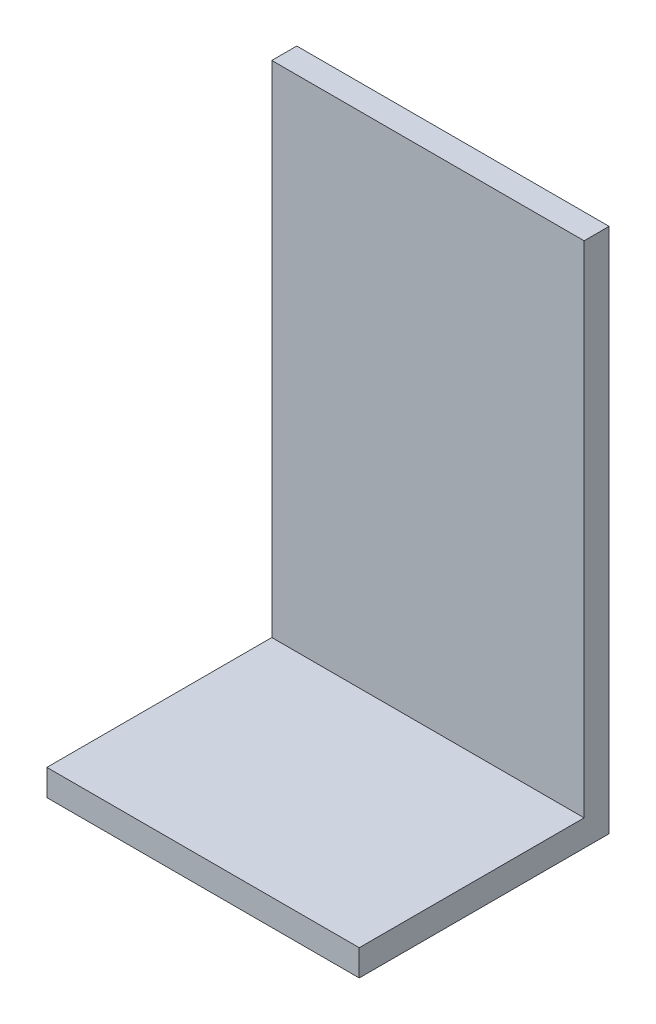
ISO-10303-21;
HEADER;
FILE_DESCRIPTION(('STEP AP214'),'2;1');
FILE_NAME('part.step','',(''),(''),'','','');
FILE_SCHEMA(('AUTOMOTIVE_DESIGN { 1 0 10303 214 1 1 1 1 }'));
ENDSEC;
DATA;
#1=APPLICATION_CONTEXT('core data for automotive mechanical design processes');
#2=APPLICATION_PROTOCOL_DEFINITION('international standard','automotive_design',2000,#1);
#3=PRODUCT_CONTEXT('',#1,'mechanical');
#4=PRODUCT('Part','Part','',(#3));
#5=PRODUCT_RELATED_PRODUCT_CATEGORY('part','',(#4));
#6=PRODUCT_DEFINITION_FORMATION('','',#4);
#7=PRODUCT_DEFINITION_CONTEXT('part definition',#1,'design');
#8=PRODUCT_DEFINITION('design','',#6,#7);
#9=PRODUCT_DEFINITION_SHAPE('','',#8);
#10=(LENGTH_UNIT() NAMED_UNIT(*) SI_UNIT(.MILLI.,.METRE.));
#11=(NAMED_UNIT(*) PLANE_ANGLE_UNIT() SI_UNIT($,.RADIAN.));
#12=(NAMED_UNIT(*) SI_UNIT($,.STERADIAN.) SOLID_ANGLE_UNIT());
#13=UNCERTAINTY_MEASURE_WITH_UNIT(LENGTH_MEASURE(1.E-05),#10,'distance_accuracy_value','');
#14=(GEOMETRIC_REPRESENTATION_CONTEXT(3) GLOBAL_UNCERTAINTY_ASSIGNED_CONTEXT((#13)) GLOBAL_UNIT_ASSIGNED_CONTEXT((#10,
#11,#12)) REPRESENTATION_CONTEXT('',''));
#15=CARTESIAN_POINT('',(0.,0.,0.));
#16=DIRECTION('',(0.,0.,1.));
#17=DIRECTION('',(1.,0.,0.));
#18=AXIS2_PLACEMENT_3D('',#15,#16,#17);
#19=CARTESIAN_POINT('',(0.22167930040457,-1.5105,0.2));
#20=DIRECTION('',(0.,0.,1.));
#21=DIRECTION('',(0.,-1.,0.));
#22=AXIS2_PLACEMENT_3D('',#19,#20,#21);
#23=PLANE('',#22);
#24=DIRECTION('',(0.,-1.,0.));
#25=VECTOR('',#24,1.);
#26=CARTESIAN_POINT('',(0.0966793004045692,-1.36847101449275,0.2));
#27=LINE('',#26,#25);
#28=CARTESIAN_POINT('',(0.0966793004045694,-1.5,0.2));
#29=VERTEX_POINT('',#28);
#30=CARTESIAN_POINT('',(0.0966793004045697,-1.521,0.2));
#31=VERTEX_POINT('',#30);
#32=EDGE_CURVE('E110',#29,#31,#27,.T.);
#33=ORIENTED_EDGE('',*,*,#32,.T.);
#34=DIRECTION('',(1.,0.,0.));
#35=VECTOR('',#34,1.);
#36=CARTESIAN_POINT('',(0.22167930040457,-1.521,0.2));
#37=LINE('',#36,#35);
#38=CARTESIAN_POINT('',(0.34667930040457,-1.521,0.2));
#39=VERTEX_POINT('',#38);
#40=EDGE_CURVE('E106',#31,#39,#37,.T.);
#41=ORIENTED_EDGE('',*,*,#40,.T.);
#42=DIRECTION('',(0.,-1.,0.));
#43=VECTOR('',#42,1.);
#44=CARTESIAN_POINT('',(0.346679300404569,-1.36847101449275,0.2));
#45=LINE('',#44,#43);
#46=CARTESIAN_POINT('',(0.34667930040457,-1.5,0.2));
#47=VERTEX_POINT('',#46);
#48=EDGE_CURVE('E147',#47,#39,#45,.T.);
#49=ORIENTED_EDGE('',*,*,#48,.F.);
#50=DIRECTION('',(1.,0.,0.));
#51=VECTOR('',#50,1.);
#52=CARTESIAN_POINT('',(0.22167930040457,-1.5,0.2));
#53=LINE('',#52,#51);
#54=EDGE_CURVE('E25',#29,#47,#53,.T.);
#55=ORIENTED_EDGE('',*,*,#54,.F.);
#56=EDGE_LOOP('',(#33,#41,#49,#55));
#57=FACE_BOUND('',#56,.T.);
#58=ADVANCED_FACE('F17',(#57),#23,.T.);
#59=CARTESIAN_POINT('',(0.221679300404569,-1.3,0.02));
#60=DIRECTION('',(0.,0.,1.));
#61=DIRECTION('',(0.,-1.,0.));
#62=AXIS2_PLACEMENT_3D('',#59,#60,#61);
#63=PLANE('',#62);
#64=DIRECTION('',(0.,-1.,0.));
#65=VECTOR('',#64,1.);
#66=CARTESIAN_POINT('',(0.346679300404569,-1.36847101449275,0.02));
#67=LINE('',#66,#65);
#68=CARTESIAN_POINT('',(0.346679300404568,-1.1,0.02));
#69=VERTEX_POINT('',#68);
#70=CARTESIAN_POINT('',(0.34667930040457,-1.5,0.02));
#71=VERTEX_POINT('',#70);
#72=EDGE_CURVE('E139',#69,#71,#67,.T.);
#73=ORIENTED_EDGE('',*,*,#72,.F.);
#74=DIRECTION('',(1.,0.,0.));
#75=VECTOR('',#74,1.);
#76=CARTESIAN_POINT('',(0.221679300404568,-1.1,0.02));
#77=LINE('',#76,#75);
#78=CARTESIAN_POINT('',(0.0966793004045681,-1.1,0.02));
#79=VERTEX_POINT('',#78);
#80=EDGE_CURVE('E38',#79,#69,#77,.T.);
#81=ORIENTED_EDGE('',*,*,#80,.F.);
#82=DIRECTION('',(0.,-1.,0.));
#83=VECTOR('',#82,1.);
#84=CARTESIAN_POINT('',(0.0966793004045692,-1.36847101449275,0.02));
#85=LINE('',#84,#83);
#86=CARTESIAN_POINT('',(0.0966793004045688,-1.5,0.02));
#87=VERTEX_POINT('',#86);
#88=EDGE_CURVE('E161',#79,#87,#85,.T.);
#89=ORIENTED_EDGE('',*,*,#88,.T.);
#90=DIRECTION('',(-1.,0.,0.));
#91=VECTOR('',#90,1.);
#92=CARTESIAN_POINT('',(0.22167930040457,-1.5,0.02));
#93=LINE('',#92,#91);
#94=EDGE_CURVE('E11',#71,#87,#93,.T.);
#95=ORIENTED_EDGE('',*,*,#94,.F.);
#96=EDGE_LOOP('',(#73,#81,#89,#95));
#97=FACE_BOUND('',#96,.T.);
#98=ADVANCED_FACE('F272',(#97),#63,.T.);
#99=CARTESIAN_POINT('',(0.22167930040457,-1.5,0.11));
#100=DIRECTION('',(0.,1.,0.));
#101=DIRECTION('',(1.,0.,0.));
#102=AXIS2_PLACEMENT_3D('',#99,#100,#101);
#103=PLANE('',#102);
#104=DIRECTION('',(0.,0.,1.));
#105=VECTOR('',#104,1.);
#106=CARTESIAN_POINT('',(0.0966793004045698,-1.5,0.0420289855072464));
#107=LINE('',#106,#105);
#108=EDGE_CURVE('E150',#87,#29,#107,.T.);
#109=ORIENTED_EDGE('',*,*,#108,.T.);
#110=ORIENTED_EDGE('',*,*,#54,.T.);
#111=DIRECTION('',(0.,0.,1.));
#112=VECTOR('',#111,1.);
#113=CARTESIAN_POINT('',(0.34667930040457,-1.5,0.0420289855072464));
#114=LINE('',#113,#112);
#115=EDGE_CURVE('E143',#71,#47,#114,.T.);
#116=ORIENTED_EDGE('',*,*,#115,.F.);
#117=ORIENTED_EDGE('',*,*,#94,.T.);
#118=EDGE_LOOP('',(#109,#110,#116,#117));
#119=FACE_BOUND('',#118,.T.);
#120=ADVANCED_FACE('F266',(#119),#103,.T.);
#121=CARTESIAN_POINT('',(0.221679300404568,-1.1,0.01));
#122=DIRECTION('',(0.,1.,0.));
#123=DIRECTION('',(1.,0.,0.));
#124=AXIS2_PLACEMENT_3D('',#121,#122,#123);
#125=PLANE('',#124);
#126=DIRECTION('',(0.,0.,1.));
#127=VECTOR('',#126,1.);
#128=CARTESIAN_POINT('',(0.346679300404568,-1.1,0.0420289855072464));
#129=LINE('',#128,#127);
#130=CARTESIAN_POINT('',(0.346679300404568,-1.1,0.));
#131=VERTEX_POINT('',#130);
#132=EDGE_CURVE('E156',#131,#69,#129,.T.);
#133=ORIENTED_EDGE('',*,*,#132,.F.);
#134=DIRECTION('',(-1.,0.,0.));
#135=VECTOR('',#134,1.);
#136=CARTESIAN_POINT('',(0.221679300404569,-1.1,0.));
#137=LINE('',#136,#135);
#138=CARTESIAN_POINT('',(0.0966793004045681,-1.1,0.));
#139=VERTEX_POINT('',#138);
#140=EDGE_CURVE('E121',#131,#139,#137,.T.);
#141=ORIENTED_EDGE('',*,*,#140,.T.);
#142=DIRECTION('',(0.,0.,1.));
#143=VECTOR('',#142,1.);
#144=CARTESIAN_POINT('',(0.0966793004045681,-1.1,0.0420289855072464));
#145=LINE('',#144,#143);
#146=EDGE_CURVE('E116',#139,#79,#145,.T.);
#147=ORIENTED_EDGE('',*,*,#146,.T.);
#148=ORIENTED_EDGE('',*,*,#80,.T.);
#149=EDGE_LOOP('',(#133,#141,#147,#148));
#150=FACE_BOUND('',#149,.T.);
#151=ADVANCED_FACE('F271',(#150),#125,.T.);
#152=CARTESIAN_POINT('',(0.0966793004045692,-1.36847101449275,0.0420289855072464));
#153=DIRECTION('',(1.,0.,0.));
#154=DIRECTION('',(0.,1.,0.));
#155=AXIS2_PLACEMENT_3D('',#152,#153,#154);
#156=PLANE('',#155);
#157=DIRECTION('',(0.,0.,1.));
#158=VECTOR('',#157,1.);
#159=CARTESIAN_POINT('',(0.0966793004045695,-1.521,0.1));
#160=LINE('',#159,#158);
#161=CARTESIAN_POINT('',(0.0966793004045693,-1.521,0.));
#162=VERTEX_POINT('',#161);
#163=EDGE_CURVE('E100',#162,#31,#160,.T.);
#164=ORIENTED_EDGE('',*,*,#163,.T.);
#165=ORIENTED_EDGE('',*,*,#32,.F.);
#166=ORIENTED_EDGE('',*,*,#108,.F.);
#167=ORIENTED_EDGE('',*,*,#88,.F.);
#168=ORIENTED_EDGE('',*,*,#146,.F.);
#169=DIRECTION('',(0.,-1.,0.));
#170=VECTOR('',#169,1.);
#171=CARTESIAN_POINT('',(0.0966793004045682,-1.3105,0.));
#172=LINE('',#171,#170);
#173=EDGE_CURVE('E113',#139,#162,#172,.T.);
#174=ORIENTED_EDGE('',*,*,#173,.T.);
#175=EDGE_LOOP('',(#164,#165,#166,#167,#168,#174));
#176=FACE_BOUND('',#175,.T.);
#177=ADVANCED_FACE('F114',(#176),#156,.F.);
#178=CARTESIAN_POINT('',(0.22167930040457,-1.521,0.1));
#179=DIRECTION('',(0.,1.,0.));
#180=DIRECTION('',(1.,0.,0.));
#181=AXIS2_PLACEMENT_3D('',#178,#179,#180);
#182=PLANE('',#181);
#183=DIRECTION('',(1.,0.,0.));
#184=VECTOR('',#183,1.);
#185=CARTESIAN_POINT('',(0.221679300404569,-1.521,0.));
#186=LINE('',#185,#184);
#187=CARTESIAN_POINT('',(0.34667930040457,-1.521,0.));
#188=VERTEX_POINT('',#187);
#189=EDGE_CURVE('E105',#162,#188,#186,.T.);
#190=ORIENTED_EDGE('',*,*,#189,.T.);
#191=DIRECTION('',(0.,0.,-1.));
#192=VECTOR('',#191,1.);
#193=CARTESIAN_POINT('',(0.34667930040457,-1.521,0.0420289855072464));
#194=LINE('',#193,#192);
#195=EDGE_CURVE('E133',#39,#188,#194,.T.);
#196=ORIENTED_EDGE('',*,*,#195,.F.);
#197=ORIENTED_EDGE('',*,*,#40,.F.);
#198=ORIENTED_EDGE('',*,*,#163,.F.);
#199=EDGE_LOOP('',(#190,#196,#197,#198));
#200=FACE_BOUND('',#199,.T.);
#201=ADVANCED_FACE('F102',(#200),#182,.F.);
#202=CARTESIAN_POINT('',(0.346679300404569,-1.36847101449275,0.0420289855072464));
#203=DIRECTION('',(1.,0.,0.));
#204=DIRECTION('',(0.,1.,0.));
#205=AXIS2_PLACEMENT_3D('',#202,#203,#204);
#206=PLANE('',#205);
#207=ORIENTED_EDGE('',*,*,#72,.T.);
#208=ORIENTED_EDGE('',*,*,#115,.T.);
#209=ORIENTED_EDGE('',*,*,#48,.T.);
#210=ORIENTED_EDGE('',*,*,#195,.T.);
#211=DIRECTION('',(0.,1.,0.));
#212=VECTOR('',#211,1.);
#213=CARTESIAN_POINT('',(0.346679300404569,-1.3105,0.));
#214=LINE('',#213,#212);
#215=EDGE_CURVE('E126',#188,#131,#214,.T.);
#216=ORIENTED_EDGE('',*,*,#215,.T.);
#217=ORIENTED_EDGE('',*,*,#132,.T.);
#218=EDGE_LOOP('',(#207,#208,#209,#210,#216,#217));
#219=FACE_BOUND('',#218,.T.);
#220=ADVANCED_FACE('F294',(#219),#206,.T.);
#221=CARTESIAN_POINT('',(0.221679300404569,-1.3105,0.));
#222=DIRECTION('',(0.,0.,1.));
#223=DIRECTION('',(0.,-1.,0.));
#224=AXIS2_PLACEMENT_3D('',#221,#222,#223);
#225=PLANE('',#224);
#226=ORIENTED_EDGE('',*,*,#189,.F.);
#227=ORIENTED_EDGE('',*,*,#173,.F.);
#228=ORIENTED_EDGE('',*,*,#140,.F.);
#229=ORIENTED_EDGE('',*,*,#215,.F.);
#230=EDGE_LOOP('',(#226,#227,#228,#229));
#231=FACE_BOUND('',#230,.T.);
#232=ADVANCED_FACE('F124',(#231),#225,.F.);
#233=CLOSED_SHELL('',(#58,#98,#120,#151,#177,#201,#220,#232));
#234=MANIFOLD_SOLID_BREP('B1',#233);
#235=ADVANCED_BREP_SHAPE_REPRESENTATION('',(#18,#234),#14);
#236=SHAPE_DEFINITION_REPRESENTATION(#9,#235);
ENDSEC;
END-ISO-10303-21;
